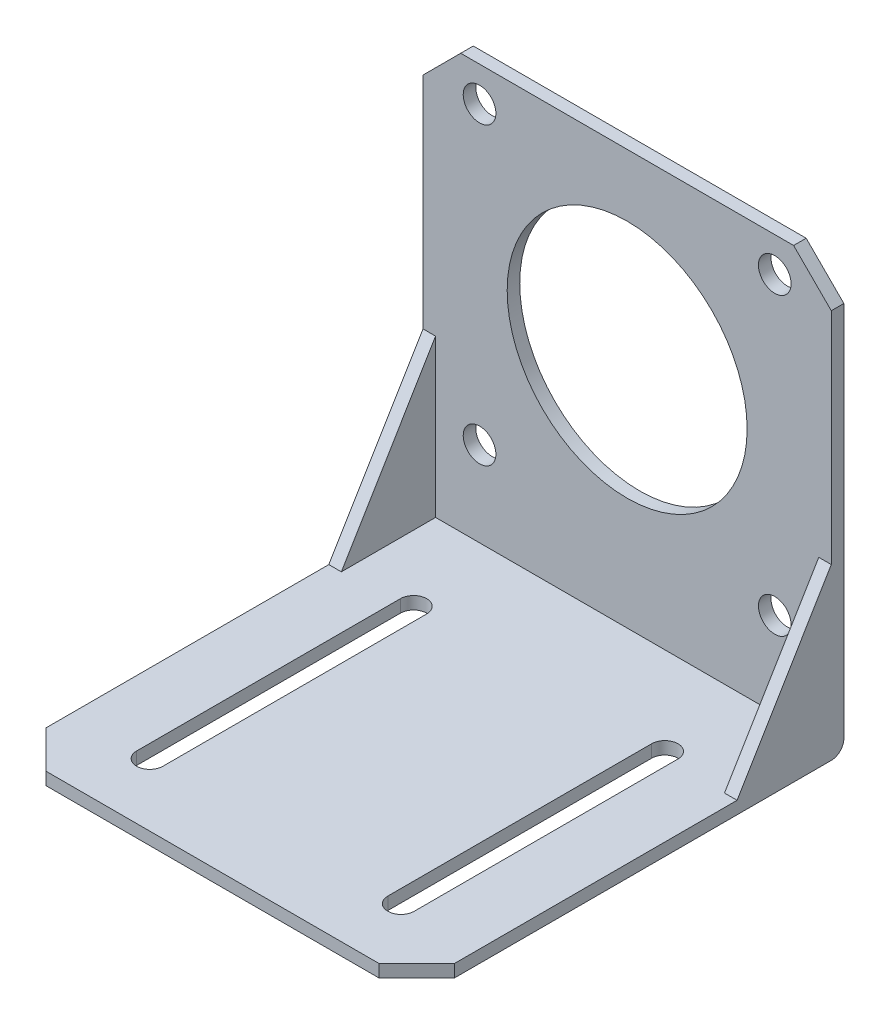
ISO-10303-21;
HEADER;
FILE_DESCRIPTION(('STEP AP214'),'2;1');
FILE_NAME('part.step','',(''),(''),'','','');
FILE_SCHEMA(('AUTOMOTIVE_DESIGN { 1 0 10303 214 1 1 1 1 }'));
ENDSEC;
DATA;
#1=APPLICATION_CONTEXT('core data for automotive mechanical design processes');
#2=APPLICATION_PROTOCOL_DEFINITION('international standard','automotive_design',2000,#1);
#3=PRODUCT_CONTEXT('',#1,'mechanical');
#4=PRODUCT('Part','Part','',(#3));
#5=PRODUCT_RELATED_PRODUCT_CATEGORY('part','',(#4));
#6=PRODUCT_DEFINITION_FORMATION('','',#4);
#7=PRODUCT_DEFINITION_CONTEXT('part definition',#1,'design');
#8=PRODUCT_DEFINITION('design','',#6,#7);
#9=PRODUCT_DEFINITION_SHAPE('','',#8);
#10=(LENGTH_UNIT() NAMED_UNIT(*) SI_UNIT(.MILLI.,.METRE.));
#11=(NAMED_UNIT(*) PLANE_ANGLE_UNIT() SI_UNIT($,.RADIAN.));
#12=(NAMED_UNIT(*) SI_UNIT($,.STERADIAN.) SOLID_ANGLE_UNIT());
#13=UNCERTAINTY_MEASURE_WITH_UNIT(LENGTH_MEASURE(1.E-05),#10,'distance_accuracy_value','');
#14=(GEOMETRIC_REPRESENTATION_CONTEXT(3) GLOBAL_UNCERTAINTY_ASSIGNED_CONTEXT((#13)) GLOBAL_UNIT_ASSIGNED_CONTEXT((#10,
#11,#12)) REPRESENTATION_CONTEXT('',''));
#15=CARTESIAN_POINT('',(0.,0.,0.));
#16=DIRECTION('',(0.,0.,1.));
#17=DIRECTION('',(1.,0.,0.));
#18=AXIS2_PLACEMENT_3D('',#15,#16,#17);
#19=CARTESIAN_POINT('',(32.5,0.,0.));
#20=DIRECTION('',(0.,0.,1.));
#21=DIRECTION('',(1.,0.,0.));
#22=AXIS2_PLACEMENT_3D('',#19,#20,#21);
#23=PLANE('',#22);
#24=CARTESIAN_POINT('',(23.5000000000007,15.5000000000007,0.));
#25=DIRECTION('',(0.,0.,1.));
#26=DIRECTION('',(1.,0.,0.));
#27=AXIS2_PLACEMENT_3D('',#24,#25,#26);
#28=CIRCLE('',#27,2.60000000000001);
#29=CARTESIAN_POINT('',(26.1000000000007,15.5000000000007,0.));
#30=VERTEX_POINT('',#29);
#31=EDGE_CURVE('E367',#30,#30,#28,.T.);
#32=ORIENTED_EDGE('',*,*,#31,.T.);
#33=EDGE_LOOP('',(#32));
#34=FACE_BOUND('',#33,.T.);
#35=CARTESIAN_POINT('',(-23.5,62.5,0.));
#36=DIRECTION('',(0.,0.,1.));
#37=DIRECTION('',(1.,0.,0.));
#38=AXIS2_PLACEMENT_3D('',#35,#36,#37);
#39=CIRCLE('',#38,2.6);
#40=CARTESIAN_POINT('',(-20.9,62.5,0.));
#41=VERTEX_POINT('',#40);
#42=EDGE_CURVE('E359',#41,#41,#39,.T.);
#43=ORIENTED_EDGE('',*,*,#42,.T.);
#44=EDGE_LOOP('',(#43));
#45=FACE_BOUND('',#44,.T.);
#46=DIRECTION('',(0.,1.,0.));
#47=VECTOR('',#46,1.);
#48=CARTESIAN_POINT('',(32.5,0.,0.));
#49=LINE('',#48,#47);
#50=CARTESIAN_POINT('',(32.5,2.,0.));
#51=VERTEX_POINT('',#50);
#52=CARTESIAN_POINT('',(32.5,62.,0.));
#53=VERTEX_POINT('',#52);
#54=EDGE_CURVE('E334',#51,#53,#49,.T.);
#55=ORIENTED_EDGE('',*,*,#54,.F.);
#56=DIRECTION('',(-1.,0.,0.));
#57=VECTOR('',#56,1.);
#58=CARTESIAN_POINT('',(32.5,2.,0.));
#59=LINE('',#58,#57);
#60=CARTESIAN_POINT('',(-32.5,2.,0.));
#61=VERTEX_POINT('',#60);
#62=EDGE_CURVE('E411',#51,#61,#59,.T.);
#63=ORIENTED_EDGE('',*,*,#62,.T.);
#64=DIRECTION('',(0.,1.,0.));
#65=VECTOR('',#64,1.);
#66=CARTESIAN_POINT('',(-32.5,0.,0.));
#67=LINE('',#66,#65);
#68=CARTESIAN_POINT('',(-32.5,62.,0.));
#69=VERTEX_POINT('',#68);
#70=EDGE_CURVE('E344',#61,#69,#67,.T.);
#71=ORIENTED_EDGE('',*,*,#70,.T.);
#72=DIRECTION('',(-0.707106781186546,-0.707106781186549,0.));
#73=VECTOR('',#72,1.);
#74=CARTESIAN_POINT('',(-26.5,68.,0.));
#75=LINE('',#74,#73);
#76=CARTESIAN_POINT('',(-26.5,68.,0.));
#77=VERTEX_POINT('',#76);
#78=EDGE_CURVE('E379',#69,#77,#75,.F.);
#79=ORIENTED_EDGE('',*,*,#78,.T.);
#80=DIRECTION('',(-1.,0.,0.));
#81=VECTOR('',#80,1.);
#82=CARTESIAN_POINT('',(32.5,68.,0.));
#83=LINE('',#82,#81);
#84=CARTESIAN_POINT('',(26.5,68.,0.));
#85=VERTEX_POINT('',#84);
#86=EDGE_CURVE('E323',#85,#77,#83,.T.);
#87=ORIENTED_EDGE('',*,*,#86,.F.);
#88=DIRECTION('',(0.70710678118655,-0.707106781186545,0.));
#89=VECTOR('',#88,1.);
#90=CARTESIAN_POINT('',(32.5,62.,0.));
#91=LINE('',#90,#89);
#92=EDGE_CURVE('E389',#85,#53,#91,.T.);
#93=ORIENTED_EDGE('',*,*,#92,.T.);
#94=EDGE_LOOP('',(#55,#63,#71,#79,#87,#93));
#95=FACE_BOUND('',#94,.T.);
#96=CARTESIAN_POINT('',(0.,39.,0.));
#97=DIRECTION('',(0.,0.,1.));
#98=DIRECTION('',(1.,0.,0.));
#99=AXIS2_PLACEMENT_3D('',#96,#97,#98);
#100=CIRCLE('',#99,19.1);
#101=CARTESIAN_POINT('',(19.1,39.,0.));
#102=VERTEX_POINT('',#101);
#103=EDGE_CURVE('E247',#102,#102,#100,.T.);
#104=ORIENTED_EDGE('',*,*,#103,.T.);
#105=EDGE_LOOP('',(#104));
#106=FACE_BOUND('',#105,.T.);
#107=CARTESIAN_POINT('',(23.5,62.5000000000007,0.));
#108=DIRECTION('',(0.,0.,1.));
#109=DIRECTION('',(1.,0.,0.));
#110=AXIS2_PLACEMENT_3D('',#107,#108,#109);
#111=CIRCLE('',#110,2.6);
#112=CARTESIAN_POINT('',(26.1,62.5000000000007,0.));
#113=VERTEX_POINT('',#112);
#114=EDGE_CURVE('E363',#113,#113,#111,.T.);
#115=ORIENTED_EDGE('',*,*,#114,.T.);
#116=EDGE_LOOP('',(#115));
#117=FACE_BOUND('',#116,.T.);
#118=CARTESIAN_POINT('',(-23.4999999999993,15.5,0.));
#119=DIRECTION('',(0.,0.,1.));
#120=DIRECTION('',(1.,0.,0.));
#121=AXIS2_PLACEMENT_3D('',#118,#119,#120);
#122=CIRCLE('',#121,2.6);
#123=CARTESIAN_POINT('',(-20.8999999999993,15.5,0.));
#124=VERTEX_POINT('',#123);
#125=EDGE_CURVE('E371',#124,#124,#122,.T.);
#126=ORIENTED_EDGE('',*,*,#125,.T.);
#127=EDGE_LOOP('',(#126));
#128=FACE_BOUND('',#127,.T.);
#129=ADVANCED_FACE('F63',(#34,#45,#95,#106,#117,#128),#23,.F.);
#130=CARTESIAN_POINT('',(32.5,68.,2.));
#131=DIRECTION('',(0.,0.,-1.));
#132=DIRECTION('',(0.,1.,0.));
#133=AXIS2_PLACEMENT_3D('',#130,#131,#132);
#134=PLANE('',#133);
#135=CARTESIAN_POINT('',(23.5000000000007,15.5000000000007,1.99999999999999));
#136=DIRECTION('',(0.,0.,-1.));
#137=DIRECTION('',(0.,1.,0.));
#138=AXIS2_PLACEMENT_3D('',#135,#136,#137);
#139=CIRCLE('',#138,2.60000000000001);
#140=CARTESIAN_POINT('',(23.5000000000007,18.1000000000007,1.99999999999999));
#141=VERTEX_POINT('',#140);
#142=EDGE_CURVE('E364',#141,#141,#139,.F.);
#143=ORIENTED_EDGE('',*,*,#142,.F.);
#144=EDGE_LOOP('',(#143));
#145=FACE_BOUND('',#144,.T.);
#146=CARTESIAN_POINT('',(-23.5,62.5,2.));
#147=DIRECTION('',(0.,0.,-1.));
#148=DIRECTION('',(0.,1.,0.));
#149=AXIS2_PLACEMENT_3D('',#146,#147,#148);
#150=CIRCLE('',#149,2.6);
#151=CARTESIAN_POINT('',(-23.5,65.1,2.));
#152=VERTEX_POINT('',#151);
#153=EDGE_CURVE('E356',#152,#152,#150,.F.);
#154=ORIENTED_EDGE('',*,*,#153,.F.);
#155=EDGE_LOOP('',(#154));
#156=FACE_BOUND('',#155,.T.);
#157=DIRECTION('',(0.,-1.,0.));
#158=VECTOR('',#157,1.);
#159=CARTESIAN_POINT('',(32.5,68.,2.));
#160=LINE('',#159,#158);
#161=CARTESIAN_POINT('',(32.5,62.,2.));
#162=VERTEX_POINT('',#161);
#163=CARTESIAN_POINT('',(32.5,27.,2.));
#164=VERTEX_POINT('',#163);
#165=EDGE_CURVE('E337',#162,#164,#160,.T.);
#166=ORIENTED_EDGE('',*,*,#165,.F.);
#167=DIRECTION('',(-0.70710678118655,0.707106781186545,0.));
#168=VECTOR('',#167,1.);
#169=CARTESIAN_POINT('',(32.5,62.,2.));
#170=LINE('',#169,#168);
#171=CARTESIAN_POINT('',(26.5,68.,2.));
#172=VERTEX_POINT('',#171);
#173=EDGE_CURVE('E385',#162,#172,#170,.T.);
#174=ORIENTED_EDGE('',*,*,#173,.T.);
#175=DIRECTION('',(-1.,0.,0.));
#176=VECTOR('',#175,1.);
#177=CARTESIAN_POINT('',(32.5,68.,2.));
#178=LINE('',#177,#176);
#179=CARTESIAN_POINT('',(-26.5,68.,2.));
#180=VERTEX_POINT('',#179);
#181=EDGE_CURVE('E353',#172,#180,#178,.T.);
#182=ORIENTED_EDGE('',*,*,#181,.T.);
#183=DIRECTION('',(0.707106781186546,0.707106781186549,0.));
#184=VECTOR('',#183,1.);
#185=CARTESIAN_POINT('',(-26.5,68.,2.));
#186=LINE('',#185,#184);
#187=CARTESIAN_POINT('',(-32.5,62.,2.));
#188=VERTEX_POINT('',#187);
#189=EDGE_CURVE('E374',#180,#188,#186,.F.);
#190=ORIENTED_EDGE('',*,*,#189,.T.);
#191=DIRECTION('',(0.,-1.,0.));
#192=VECTOR('',#191,1.);
#193=CARTESIAN_POINT('',(-32.5,68.,2.));
#194=LINE('',#193,#192);
#195=CARTESIAN_POINT('',(-32.5,27.,2.));
#196=VERTEX_POINT('',#195);
#197=EDGE_CURVE('E346',#188,#196,#194,.T.);
#198=ORIENTED_EDGE('',*,*,#197,.T.);
#199=DIRECTION('',(-1.,0.,0.));
#200=VECTOR('',#199,1.);
#201=CARTESIAN_POINT('',(32.5,27.,2.));
#202=LINE('',#201,#200);
#203=CARTESIAN_POINT('',(-30.5,27.,2.));
#204=VERTEX_POINT('',#203);
#205=EDGE_CURVE('E319',#204,#196,#202,.T.);
#206=ORIENTED_EDGE('',*,*,#205,.F.);
#207=DIRECTION('',(0.,1.,0.));
#208=VECTOR('',#207,1.);
#209=CARTESIAN_POINT('',(-30.5,27.,2.));
#210=LINE('',#209,#208);
#211=CARTESIAN_POINT('',(-30.5,2.00000000000001,2.));
#212=VERTEX_POINT('',#211);
#213=EDGE_CURVE('E302',#212,#204,#210,.T.);
#214=ORIENTED_EDGE('',*,*,#213,.F.);
#215=DIRECTION('',(1.,0.,0.));
#216=VECTOR('',#215,1.);
#217=CARTESIAN_POINT('',(-30.5,2.00000000000001,2.));
#218=LINE('',#217,#216);
#219=CARTESIAN_POINT('',(30.5,2.00000000000001,2.));
#220=VERTEX_POINT('',#219);
#221=EDGE_CURVE('E307',#212,#220,#218,.T.);
#222=ORIENTED_EDGE('',*,*,#221,.T.);
#223=DIRECTION('',(0.,1.,0.));
#224=VECTOR('',#223,1.);
#225=CARTESIAN_POINT('',(30.5,27.,2.));
#226=LINE('',#225,#224);
#227=CARTESIAN_POINT('',(30.5,27.,2.));
#228=VERTEX_POINT('',#227);
#229=EDGE_CURVE('E310',#220,#228,#226,.T.);
#230=ORIENTED_EDGE('',*,*,#229,.T.);
#231=EDGE_CURVE('E324',#164,#228,#202,.T.);
#232=ORIENTED_EDGE('',*,*,#231,.F.);
#233=EDGE_LOOP('',(#166,#174,#182,#190,#198,#206,#214,#222,#230,#232));
#234=FACE_BOUND('',#233,.T.);
#235=CARTESIAN_POINT('',(0.,39.,2.));
#236=DIRECTION('',(0.,0.,-1.));
#237=DIRECTION('',(0.,1.,0.));
#238=AXIS2_PLACEMENT_3D('',#235,#236,#237);
#239=CIRCLE('',#238,19.1);
#240=CARTESIAN_POINT('',(0.,58.1,2.));
#241=VERTEX_POINT('',#240);
#242=EDGE_CURVE('E244',#241,#241,#239,.F.);
#243=ORIENTED_EDGE('',*,*,#242,.F.);
#244=EDGE_LOOP('',(#243));
#245=FACE_BOUND('',#244,.T.);
#246=CARTESIAN_POINT('',(23.5,62.5000000000007,2.));
#247=DIRECTION('',(0.,0.,-1.));
#248=DIRECTION('',(0.,1.,0.));
#249=AXIS2_PLACEMENT_3D('',#246,#247,#248);
#250=CIRCLE('',#249,2.6);
#251=CARTESIAN_POINT('',(23.5,65.1000000000007,2.));
#252=VERTEX_POINT('',#251);
#253=EDGE_CURVE('E360',#252,#252,#250,.F.);
#254=ORIENTED_EDGE('',*,*,#253,.F.);
#255=EDGE_LOOP('',(#254));
#256=FACE_BOUND('',#255,.T.);
#257=CARTESIAN_POINT('',(-23.4999999999993,15.5,1.99999999999999));
#258=DIRECTION('',(0.,0.,-1.));
#259=DIRECTION('',(0.,1.,0.));
#260=AXIS2_PLACEMENT_3D('',#257,#258,#259);
#261=CIRCLE('',#260,2.6);
#262=CARTESIAN_POINT('',(-23.4999999999993,18.1,1.99999999999999));
#263=VERTEX_POINT('',#262);
#264=EDGE_CURVE('E368',#263,#263,#261,.F.);
#265=ORIENTED_EDGE('',*,*,#264,.F.);
#266=EDGE_LOOP('',(#265));
#267=FACE_BOUND('',#266,.T.);
#268=ADVANCED_FACE('F441',(#145,#156,#234,#245,#256,#267),#134,.F.);
#269=CARTESIAN_POINT('',(32.5,0.,68.));
#270=DIRECTION('',(0.,1.,0.));
#271=DIRECTION('',(0.,0.,1.));
#272=AXIS2_PLACEMENT_3D('',#269,#270,#271);
#273=PLANE('',#272);
#274=CARTESIAN_POINT('',(-20.,0.,16.));
#275=DIRECTION('',(0.,1.,0.));
#276=DIRECTION('',(0.,0.,1.));
#277=AXIS2_PLACEMENT_3D('',#274,#275,#276);
#278=CIRCLE('',#277,2.1);
#279=CARTESIAN_POINT('',(-17.9,0.,16.));
#280=VERTEX_POINT('',#279);
#281=CARTESIAN_POINT('',(-22.1,0.,16.));
#282=VERTEX_POINT('',#281);
#283=EDGE_CURVE('E228',#280,#282,#278,.T.);
#284=ORIENTED_EDGE('',*,*,#283,.T.);
#285=DIRECTION('',(0.,0.,1.));
#286=VECTOR('',#285,1.);
#287=CARTESIAN_POINT('',(-22.1,0.,16.));
#288=LINE('',#287,#286);
#289=CARTESIAN_POINT('',(-22.1,0.,58.));
#290=VERTEX_POINT('',#289);
#291=EDGE_CURVE('E261',#282,#290,#288,.T.);
#292=ORIENTED_EDGE('',*,*,#291,.T.);
#293=CARTESIAN_POINT('',(-20.,0.,58.));
#294=DIRECTION('',(0.,1.,0.));
#295=DIRECTION('',(0.,0.,1.));
#296=AXIS2_PLACEMENT_3D('',#293,#294,#295);
#297=CIRCLE('',#296,2.1);
#298=CARTESIAN_POINT('',(-17.9,0.,58.));
#299=VERTEX_POINT('',#298);
#300=EDGE_CURVE('E264',#290,#299,#297,.T.);
#301=ORIENTED_EDGE('',*,*,#300,.T.);
#302=DIRECTION('',(0.,0.,-1.));
#303=VECTOR('',#302,1.);
#304=CARTESIAN_POINT('',(-17.9,0.,16.));
#305=LINE('',#304,#303);
#306=EDGE_CURVE('E267',#299,#280,#305,.T.);
#307=ORIENTED_EDGE('',*,*,#306,.T.);
#308=EDGE_LOOP('',(#284,#292,#301,#307));
#309=FACE_BOUND('',#308,.T.);
#310=DIRECTION('',(0.,0.,-1.));
#311=VECTOR('',#310,1.);
#312=CARTESIAN_POINT('',(-32.5,0.,68.));
#313=LINE('',#312,#311);
#314=CARTESIAN_POINT('',(-32.5,0.,62.));
#315=VERTEX_POINT('',#314);
#316=CARTESIAN_POINT('',(-32.5,0.,2.));
#317=VERTEX_POINT('',#316);
#318=EDGE_CURVE('E315',#315,#317,#313,.T.);
#319=ORIENTED_EDGE('',*,*,#318,.T.);
#320=DIRECTION('',(-1.,0.,0.));
#321=VECTOR('',#320,1.);
#322=CARTESIAN_POINT('',(32.5,0.,2.));
#323=LINE('',#322,#321);
#324=CARTESIAN_POINT('',(32.5,0.,2.));
#325=VERTEX_POINT('',#324);
#326=EDGE_CURVE('E71',#317,#325,#323,.F.);
#327=ORIENTED_EDGE('',*,*,#326,.T.);
#328=DIRECTION('',(0.,0.,-1.));
#329=VECTOR('',#328,1.);
#330=CARTESIAN_POINT('',(32.5,0.,68.));
#331=LINE('',#330,#329);
#332=CARTESIAN_POINT('',(32.5,0.,62.));
#333=VERTEX_POINT('',#332);
#334=EDGE_CURVE('E332',#333,#325,#331,.T.);
#335=ORIENTED_EDGE('',*,*,#334,.F.);
#336=DIRECTION('',(-0.70710678118655,0.,0.707106781186545));
#337=VECTOR('',#336,1.);
#338=CARTESIAN_POINT('',(32.5,0.,62.));
#339=LINE('',#338,#337);
#340=CARTESIAN_POINT('',(26.5,0.,68.));
#341=VERTEX_POINT('',#340);
#342=EDGE_CURVE('E405',#333,#341,#339,.T.);
#343=ORIENTED_EDGE('',*,*,#342,.T.);
#344=DIRECTION('',(-1.,0.,0.));
#345=VECTOR('',#344,1.);
#346=CARTESIAN_POINT('',(32.5,0.,68.));
#347=LINE('',#346,#345);
#348=CARTESIAN_POINT('',(-26.5,0.,68.));
#349=VERTEX_POINT('',#348);
#350=EDGE_CURVE('E342',#341,#349,#347,.T.);
#351=ORIENTED_EDGE('',*,*,#350,.T.);
#352=DIRECTION('',(0.707106781186546,0.,0.707106781186549));
#353=VECTOR('',#352,1.);
#354=CARTESIAN_POINT('',(-26.5,0.,68.));
#355=LINE('',#354,#353);
#356=EDGE_CURVE('E395',#349,#315,#355,.F.);
#357=ORIENTED_EDGE('',*,*,#356,.T.);
#358=EDGE_LOOP('',(#319,#327,#335,#343,#351,#357));
#359=FACE_BOUND('',#358,.T.);
#360=CARTESIAN_POINT('',(20.,0.,16.));
#361=DIRECTION('',(0.,1.,0.));
#362=DIRECTION('',(0.,0.,-1.));
#363=AXIS2_PLACEMENT_3D('',#360,#361,#362);
#364=CIRCLE('',#363,2.1);
#365=CARTESIAN_POINT('',(22.1,0.,16.));
#366=VERTEX_POINT('',#365);
#367=CARTESIAN_POINT('',(17.9,0.,16.));
#368=VERTEX_POINT('',#367);
#369=EDGE_CURVE('E222',#366,#368,#364,.T.);
#370=ORIENTED_EDGE('',*,*,#369,.T.);
#371=DIRECTION('',(0.,0.,1.));
#372=VECTOR('',#371,1.);
#373=CARTESIAN_POINT('',(17.9,0.,16.));
#374=LINE('',#373,#372);
#375=CARTESIAN_POINT('',(17.9,0.,58.));
#376=VERTEX_POINT('',#375);
#377=EDGE_CURVE('E232',#368,#376,#374,.T.);
#378=ORIENTED_EDGE('',*,*,#377,.T.);
#379=CARTESIAN_POINT('',(20.,0.,58.));
#380=DIRECTION('',(0.,1.,0.));
#381=DIRECTION('',(0.,0.,-1.));
#382=AXIS2_PLACEMENT_3D('',#379,#380,#381);
#383=CIRCLE('',#382,2.1);
#384=CARTESIAN_POINT('',(22.1,0.,58.));
#385=VERTEX_POINT('',#384);
#386=EDGE_CURVE('E238',#376,#385,#383,.T.);
#387=ORIENTED_EDGE('',*,*,#386,.T.);
#388=DIRECTION('',(0.,0.,-1.));
#389=VECTOR('',#388,1.);
#390=CARTESIAN_POINT('',(22.1,0.,16.));
#391=LINE('',#390,#389);
#392=EDGE_CURVE('E243',#385,#366,#391,.T.);
#393=ORIENTED_EDGE('',*,*,#392,.T.);
#394=EDGE_LOOP('',(#370,#378,#387,#393));
#395=FACE_BOUND('',#394,.T.);
#396=ADVANCED_FACE('F241',(#309,#359,#395),#273,.F.);
#397=CARTESIAN_POINT('',(32.5,2.00000000000001,1.99999999999999));
#398=DIRECTION('',(0.,-1.,0.));
#399=DIRECTION('',(0.,0.,-1.));
#400=AXIS2_PLACEMENT_3D('',#397,#398,#399);
#401=PLANE('',#400);
#402=DIRECTION('',(0.,0.,1.));
#403=VECTOR('',#402,1.);
#404=CARTESIAN_POINT('',(17.9,2.00000000000001,1.99999999999999));
#405=LINE('',#404,#403);
#406=CARTESIAN_POINT('',(17.9,2.,16.));
#407=VERTEX_POINT('',#406);
#408=CARTESIAN_POINT('',(17.9,2.,58.));
#409=VERTEX_POINT('',#408);
#410=EDGE_CURVE('E285',#407,#409,#405,.T.);
#411=ORIENTED_EDGE('',*,*,#410,.F.);
#412=CARTESIAN_POINT('',(20.,2.00000000000002,16.));
#413=DIRECTION('',(0.,-1.,0.));
#414=DIRECTION('',(0.,0.,-1.));
#415=AXIS2_PLACEMENT_3D('',#412,#413,#414);
#416=CIRCLE('',#415,2.1);
#417=CARTESIAN_POINT('',(22.1,2.,16.));
#418=VERTEX_POINT('',#417);
#419=EDGE_CURVE('E225',#407,#418,#416,.T.);
#420=ORIENTED_EDGE('',*,*,#419,.T.);
#421=DIRECTION('',(0.,0.,1.));
#422=VECTOR('',#421,1.);
#423=CARTESIAN_POINT('',(22.1,2.00000000000001,1.99999999999999));
#424=LINE('',#423,#422);
#425=CARTESIAN_POINT('',(22.1,2.,58.));
#426=VERTEX_POINT('',#425);
#427=EDGE_CURVE('E279',#418,#426,#424,.T.);
#428=ORIENTED_EDGE('',*,*,#427,.T.);
#429=CARTESIAN_POINT('',(20.,2.,58.));
#430=DIRECTION('',(0.,-1.,0.));
#431=DIRECTION('',(0.,0.,-1.));
#432=AXIS2_PLACEMENT_3D('',#429,#430,#431);
#433=CIRCLE('',#432,2.09999999999999);
#434=EDGE_CURVE('E282',#426,#409,#433,.T.);
#435=ORIENTED_EDGE('',*,*,#434,.T.);
#436=EDGE_LOOP('',(#411,#420,#428,#435));
#437=FACE_BOUND('',#436,.T.);
#438=DIRECTION('',(-1.,0.,0.));
#439=VECTOR('',#438,1.);
#440=CARTESIAN_POINT('',(32.5,2.,68.));
#441=LINE('',#440,#439);
#442=CARTESIAN_POINT('',(26.5,2.,68.));
#443=VERTEX_POINT('',#442);
#444=CARTESIAN_POINT('',(-26.5,2.,68.));
#445=VERTEX_POINT('',#444);
#446=EDGE_CURVE('E351',#443,#445,#441,.T.);
#447=ORIENTED_EDGE('',*,*,#446,.F.);
#448=DIRECTION('',(0.70710678118655,0.,-0.707106781186545));
#449=VECTOR('',#448,1.);
#450=CARTESIAN_POINT('',(32.5,2.,62.));
#451=LINE('',#450,#449);
#452=CARTESIAN_POINT('',(32.5,2.,62.));
#453=VERTEX_POINT('',#452);
#454=EDGE_CURVE('E409',#443,#453,#451,.T.);
#455=ORIENTED_EDGE('',*,*,#454,.T.);
#456=DIRECTION('',(0.,0.,1.));
#457=VECTOR('',#456,1.);
#458=CARTESIAN_POINT('',(32.5,2.00000000000001,1.99999999999999));
#459=LINE('',#458,#457);
#460=CARTESIAN_POINT('',(32.5,2.00000000000001,17.));
#461=VERTEX_POINT('',#460);
#462=EDGE_CURVE('E339',#461,#453,#459,.T.);
#463=ORIENTED_EDGE('',*,*,#462,.F.);
#464=DIRECTION('',(-1.,0.,0.));
#465=VECTOR('',#464,1.);
#466=CARTESIAN_POINT('',(32.5,2.00000000000001,17.));
#467=LINE('',#466,#465);
#468=CARTESIAN_POINT('',(30.5,2.00000000000001,17.));
#469=VERTEX_POINT('',#468);
#470=EDGE_CURVE('E328',#461,#469,#467,.T.);
#471=ORIENTED_EDGE('',*,*,#470,.T.);
#472=DIRECTION('',(0.,0.,-1.));
#473=VECTOR('',#472,1.);
#474=CARTESIAN_POINT('',(30.5,2.00000000000001,2.));
#475=LINE('',#474,#473);
#476=EDGE_CURVE('E298',#469,#220,#475,.T.);
#477=ORIENTED_EDGE('',*,*,#476,.T.);
#478=ORIENTED_EDGE('',*,*,#221,.F.);
#479=DIRECTION('',(0.,0.,-1.));
#480=VECTOR('',#479,1.);
#481=CARTESIAN_POINT('',(-30.5,2.00000000000001,2.));
#482=LINE('',#481,#480);
#483=CARTESIAN_POINT('',(-30.5,2.00000000000001,17.));
#484=VERTEX_POINT('',#483);
#485=EDGE_CURVE('E299',#484,#212,#482,.T.);
#486=ORIENTED_EDGE('',*,*,#485,.F.);
#487=CARTESIAN_POINT('',(-32.5,2.00000000000001,17.));
#488=VERTEX_POINT('',#487);
#489=EDGE_CURVE('E327',#484,#488,#467,.T.);
#490=ORIENTED_EDGE('',*,*,#489,.T.);
#491=DIRECTION('',(0.,0.,1.));
#492=VECTOR('',#491,1.);
#493=CARTESIAN_POINT('',(-32.5,2.00000000000001,1.99999999999999));
#494=LINE('',#493,#492);
#495=CARTESIAN_POINT('',(-32.5,2.,62.));
#496=VERTEX_POINT('',#495);
#497=EDGE_CURVE('E335',#488,#496,#494,.T.);
#498=ORIENTED_EDGE('',*,*,#497,.T.);
#499=DIRECTION('',(-0.707106781186546,0.,-0.707106781186549));
#500=VECTOR('',#499,1.);
#501=CARTESIAN_POINT('',(-26.5,2.,68.));
#502=LINE('',#501,#500);
#503=EDGE_CURVE('E399',#496,#445,#502,.F.);
#504=ORIENTED_EDGE('',*,*,#503,.T.);
#505=EDGE_LOOP('',(#447,#455,#463,#471,#477,#478,#486,#490,#498,#504));
#506=FACE_BOUND('',#505,.T.);
#507=CARTESIAN_POINT('',(-20.,2.00000000000002,16.));
#508=DIRECTION('',(0.,-1.,0.));
#509=DIRECTION('',(0.,0.,-1.));
#510=AXIS2_PLACEMENT_3D('',#507,#508,#509);
#511=CIRCLE('',#510,2.1);
#512=CARTESIAN_POINT('',(-17.9,2.,16.));
#513=VERTEX_POINT('',#512);
#514=CARTESIAN_POINT('',(-22.1,2.,16.));
#515=VERTEX_POINT('',#514);
#516=EDGE_CURVE('E296',#513,#515,#511,.F.);
#517=ORIENTED_EDGE('',*,*,#516,.F.);
#518=DIRECTION('',(0.,0.,1.));
#519=VECTOR('',#518,1.);
#520=CARTESIAN_POINT('',(-17.9,2.00000000000001,1.99999999999999));
#521=LINE('',#520,#519);
#522=CARTESIAN_POINT('',(-17.9,2.,58.));
#523=VERTEX_POINT('',#522);
#524=EDGE_CURVE('E288',#513,#523,#521,.T.);
#525=ORIENTED_EDGE('',*,*,#524,.T.);
#526=CARTESIAN_POINT('',(-20.,2.,58.));
#527=DIRECTION('',(0.,-1.,0.));
#528=DIRECTION('',(0.,0.,-1.));
#529=AXIS2_PLACEMENT_3D('',#526,#527,#528);
#530=CIRCLE('',#529,2.09999999999999);
#531=CARTESIAN_POINT('',(-22.1,2.,58.));
#532=VERTEX_POINT('',#531);
#533=EDGE_CURVE('E291',#532,#523,#530,.F.);
#534=ORIENTED_EDGE('',*,*,#533,.F.);
#535=DIRECTION('',(0.,0.,1.));
#536=VECTOR('',#535,1.);
#537=CARTESIAN_POINT('',(-22.1,2.00000000000001,2.00000000000001));
#538=LINE('',#537,#536);
#539=EDGE_CURVE('E294',#515,#532,#538,.T.);
#540=ORIENTED_EDGE('',*,*,#539,.F.);
#541=EDGE_LOOP('',(#517,#525,#534,#540));
#542=FACE_BOUND('',#541,.T.);
#543=ADVANCED_FACE('F467',(#437,#506,#542),#401,.F.);
#544=CARTESIAN_POINT('',(32.5,8.02941176470588,13.3823529411765));
#545=DIRECTION('',(0.,0.514495755427526,0.857492925712544));
#546=DIRECTION('',(0.,-0.857492925712544,0.514495755427526));
#547=AXIS2_PLACEMENT_3D('',#544,#545,#546);
#548=PLANE('',#547);
#549=ORIENTED_EDGE('',*,*,#489,.F.);
#550=DIRECTION('',(0.,-0.857492925712544,0.514495755427526));
#551=VECTOR('',#550,1.);
#552=CARTESIAN_POINT('',(-30.5,2.00000000000001,17.));
#553=LINE('',#552,#551);
#554=EDGE_CURVE('E305',#204,#484,#553,.T.);
#555=ORIENTED_EDGE('',*,*,#554,.F.);
#556=ORIENTED_EDGE('',*,*,#205,.T.);
#557=DIRECTION('',(0.,0.857492925712544,-0.514495755427526));
#558=VECTOR('',#557,1.);
#559=CARTESIAN_POINT('',(-32.5,8.02941176470588,13.3823529411765));
#560=LINE('',#559,#558);
#561=EDGE_CURVE('E320',#488,#196,#560,.T.);
#562=ORIENTED_EDGE('',*,*,#561,.F.);
#563=EDGE_LOOP('',(#549,#555,#556,#562));
#564=FACE_BOUND('',#563,.T.);
#565=ADVANCED_FACE('F473',(#564),#548,.T.);
#566=DIRECTION('',(0.,-0.857492925712544,0.514495755427526));
#567=VECTOR('',#566,1.);
#568=CARTESIAN_POINT('',(30.5,2.00000000000001,17.));
#569=LINE('',#568,#567);
#570=EDGE_CURVE('E303',#228,#469,#569,.T.);
#571=ORIENTED_EDGE('',*,*,#570,.T.);
#572=ORIENTED_EDGE('',*,*,#470,.F.);
#573=DIRECTION('',(0.,0.857492925712544,-0.514495755427526));
#574=VECTOR('',#573,1.);
#575=CARTESIAN_POINT('',(32.5,8.02941176470588,13.3823529411765));
#576=LINE('',#575,#574);
#577=EDGE_CURVE('E316',#461,#164,#576,.T.);
#578=ORIENTED_EDGE('',*,*,#577,.T.);
#579=ORIENTED_EDGE('',*,*,#231,.T.);
#580=EDGE_LOOP('',(#571,#572,#578,#579));
#581=FACE_BOUND('',#580,.T.);
#582=ADVANCED_FACE('F447',(#581),#548,.T.);
#583=CARTESIAN_POINT('',(-32.5,0.,0.));
#584=DIRECTION('',(1.,0.,0.));
#585=DIRECTION('',(0.,0.,-1.));
#586=AXIS2_PLACEMENT_3D('',#583,#584,#585);
#587=PLANE('',#586);
#588=ORIENTED_EDGE('',*,*,#70,.F.);
#589=CARTESIAN_POINT('',(-32.5,2.,2.));
#590=DIRECTION('',(1.,0.,0.));
#591=DIRECTION('',(0.,0.,-1.));
#592=AXIS2_PLACEMENT_3D('',#589,#590,#591);
#593=CIRCLE('',#592,2.);
#594=EDGE_CURVE('E85',#61,#317,#593,.F.);
#595=ORIENTED_EDGE('',*,*,#594,.T.);
#596=ORIENTED_EDGE('',*,*,#318,.F.);
#597=DIRECTION('',(0.,1.,0.));
#598=VECTOR('',#597,1.);
#599=CARTESIAN_POINT('',(-32.5,0.,62.));
#600=LINE('',#599,#598);
#601=EDGE_CURVE('E397',#315,#496,#600,.T.);
#602=ORIENTED_EDGE('',*,*,#601,.T.);
#603=ORIENTED_EDGE('',*,*,#497,.F.);
#604=ORIENTED_EDGE('',*,*,#561,.T.);
#605=ORIENTED_EDGE('',*,*,#197,.F.);
#606=DIRECTION('',(0.,0.,-1.));
#607=VECTOR('',#606,1.);
#608=CARTESIAN_POINT('',(-32.5,62.,0.));
#609=LINE('',#608,#607);
#610=EDGE_CURVE('E376',#188,#69,#609,.T.);
#611=ORIENTED_EDGE('',*,*,#610,.T.);
#612=EDGE_LOOP('',(#588,#595,#596,#602,#603,#604,#605,#611));
#613=FACE_BOUND('',#612,.T.);
#614=ADVANCED_FACE('F420',(#613),#587,.F.);
#615=CARTESIAN_POINT('',(32.5,0.,0.));
#616=DIRECTION('',(1.,0.,0.));
#617=DIRECTION('',(0.,0.,-1.));
#618=AXIS2_PLACEMENT_3D('',#615,#616,#617);
#619=PLANE('',#618);
#620=ORIENTED_EDGE('',*,*,#334,.T.);
#621=CARTESIAN_POINT('',(32.5,2.,2.));
#622=DIRECTION('',(1.,0.,0.));
#623=DIRECTION('',(0.,0.,-1.));
#624=AXIS2_PLACEMENT_3D('',#621,#622,#623);
#625=CIRCLE('',#624,2.);
#626=EDGE_CURVE('E12',#325,#51,#625,.T.);
#627=ORIENTED_EDGE('',*,*,#626,.T.);
#628=ORIENTED_EDGE('',*,*,#54,.T.);
#629=DIRECTION('',(0.,0.,1.));
#630=VECTOR('',#629,1.);
#631=CARTESIAN_POINT('',(32.5,62.,2.));
#632=LINE('',#631,#630);
#633=EDGE_CURVE('E382',#53,#162,#632,.T.);
#634=ORIENTED_EDGE('',*,*,#633,.T.);
#635=ORIENTED_EDGE('',*,*,#165,.T.);
#636=ORIENTED_EDGE('',*,*,#577,.F.);
#637=ORIENTED_EDGE('',*,*,#462,.T.);
#638=DIRECTION('',(0.,-1.,0.));
#639=VECTOR('',#638,1.);
#640=CARTESIAN_POINT('',(32.5,0.,62.));
#641=LINE('',#640,#639);
#642=EDGE_CURVE('E402',#453,#333,#641,.T.);
#643=ORIENTED_EDGE('',*,*,#642,.T.);
#644=EDGE_LOOP('',(#620,#627,#628,#634,#635,#636,#637,#643));
#645=FACE_BOUND('',#644,.T.);
#646=ADVANCED_FACE('F437',(#645),#619,.T.);
#647=CARTESIAN_POINT('',(32.5,68.,0.));
#648=DIRECTION('',(0.,-1.,0.));
#649=DIRECTION('',(0.,0.,-1.));
#650=AXIS2_PLACEMENT_3D('',#647,#648,#649);
#651=PLANE('',#650);
#652=ORIENTED_EDGE('',*,*,#181,.F.);
#653=DIRECTION('',(0.,0.,-1.));
#654=VECTOR('',#653,1.);
#655=CARTESIAN_POINT('',(26.5,68.,0.));
#656=LINE('',#655,#654);
#657=EDGE_CURVE('E387',#172,#85,#656,.T.);
#658=ORIENTED_EDGE('',*,*,#657,.T.);
#659=ORIENTED_EDGE('',*,*,#86,.T.);
#660=DIRECTION('',(0.,0.,1.));
#661=VECTOR('',#660,1.);
#662=CARTESIAN_POINT('',(-26.5,68.,0.));
#663=LINE('',#662,#661);
#664=EDGE_CURVE('E331',#77,#180,#663,.T.);
#665=ORIENTED_EDGE('',*,*,#664,.T.);
#666=EDGE_LOOP('',(#652,#658,#659,#665));
#667=FACE_BOUND('',#666,.T.);
#668=ADVANCED_FACE('F477',(#667),#651,.F.);
#669=CARTESIAN_POINT('',(32.5,2.,68.));
#670=DIRECTION('',(0.,0.,-1.));
#671=DIRECTION('',(-1.,0.,0.));
#672=AXIS2_PLACEMENT_3D('',#669,#670,#671);
#673=PLANE('',#672);
#674=ORIENTED_EDGE('',*,*,#350,.F.);
#675=DIRECTION('',(0.,1.,0.));
#676=VECTOR('',#675,1.);
#677=CARTESIAN_POINT('',(26.5,2.,68.));
#678=LINE('',#677,#676);
#679=EDGE_CURVE('E407',#341,#443,#678,.T.);
#680=ORIENTED_EDGE('',*,*,#679,.T.);
#681=ORIENTED_EDGE('',*,*,#446,.T.);
#682=DIRECTION('',(0.,-1.,0.));
#683=VECTOR('',#682,1.);
#684=CARTESIAN_POINT('',(-26.5,2.,68.));
#685=LINE('',#684,#683);
#686=EDGE_CURVE('E392',#445,#349,#685,.T.);
#687=ORIENTED_EDGE('',*,*,#686,.T.);
#688=EDGE_LOOP('',(#674,#680,#681,#687));
#689=FACE_BOUND('',#688,.T.);
#690=ADVANCED_FACE('F458',(#689),#673,.F.);
#691=CARTESIAN_POINT('',(-30.5,0.,0.));
#692=DIRECTION('',(1.,0.,0.));
#693=DIRECTION('',(0.,0.,-1.));
#694=AXIS2_PLACEMENT_3D('',#691,#692,#693);
#695=PLANE('',#694);
#696=ORIENTED_EDGE('',*,*,#485,.T.);
#697=ORIENTED_EDGE('',*,*,#213,.T.);
#698=ORIENTED_EDGE('',*,*,#554,.T.);
#699=EDGE_LOOP('',(#696,#697,#698));
#700=FACE_BOUND('',#699,.T.);
#701=ADVANCED_FACE('F484',(#700),#695,.T.);
#702=CARTESIAN_POINT('',(30.5,0.,0.));
#703=DIRECTION('',(1.,0.,0.));
#704=DIRECTION('',(0.,0.,-1.));
#705=AXIS2_PLACEMENT_3D('',#702,#703,#704);
#706=PLANE('',#705);
#707=ORIENTED_EDGE('',*,*,#476,.F.);
#708=ORIENTED_EDGE('',*,*,#570,.F.);
#709=ORIENTED_EDGE('',*,*,#229,.F.);
#710=EDGE_LOOP('',(#707,#708,#709));
#711=FACE_BOUND('',#710,.T.);
#712=ADVANCED_FACE('F716',(#711),#706,.F.);
#713=CARTESIAN_POINT('',(-20.,68.,16.));
#714=DIRECTION('',(0.,-1.,0.));
#715=DIRECTION('',(0.,0.,-1.));
#716=AXIS2_PLACEMENT_3D('',#713,#714,#715);
#717=CYLINDRICAL_SURFACE('',#716,2.1);
#718=ORIENTED_EDGE('',*,*,#516,.T.);
#719=DIRECTION('',(0.,-1.,0.));
#720=VECTOR('',#719,1.);
#721=CARTESIAN_POINT('',(-22.1,68.,16.));
#722=LINE('',#721,#720);
#723=EDGE_CURVE('E277',#515,#282,#722,.T.);
#724=ORIENTED_EDGE('',*,*,#723,.T.);
#725=ORIENTED_EDGE('',*,*,#283,.F.);
#726=DIRECTION('',(0.,-1.,0.));
#727=VECTOR('',#726,1.);
#728=CARTESIAN_POINT('',(-17.9,68.,16.));
#729=LINE('',#728,#727);
#730=EDGE_CURVE('E270',#513,#280,#729,.T.);
#731=ORIENTED_EDGE('',*,*,#730,.F.);
#732=EDGE_LOOP('',(#718,#724,#725,#731));
#733=FACE_BOUND('',#732,.T.);
#734=ADVANCED_FACE('F707',(#733),#717,.F.);
#735=CARTESIAN_POINT('',(-22.1,68.,16.));
#736=DIRECTION('',(1.,0.,0.));
#737=DIRECTION('',(0.,0.,-1.));
#738=AXIS2_PLACEMENT_3D('',#735,#736,#737);
#739=PLANE('',#738);
#740=ORIENTED_EDGE('',*,*,#539,.T.);
#741=DIRECTION('',(0.,-1.,0.));
#742=VECTOR('',#741,1.);
#743=CARTESIAN_POINT('',(-22.1,68.,58.));
#744=LINE('',#743,#742);
#745=EDGE_CURVE('E275',#532,#290,#744,.T.);
#746=ORIENTED_EDGE('',*,*,#745,.T.);
#747=ORIENTED_EDGE('',*,*,#291,.F.);
#748=ORIENTED_EDGE('',*,*,#723,.F.);
#749=EDGE_LOOP('',(#740,#746,#747,#748));
#750=FACE_BOUND('',#749,.T.);
#751=ADVANCED_FACE('F697',(#750),#739,.T.);
#752=CARTESIAN_POINT('',(-20.,68.,58.));
#753=DIRECTION('',(0.,-1.,0.));
#754=DIRECTION('',(0.,0.,-1.));
#755=AXIS2_PLACEMENT_3D('',#752,#753,#754);
#756=CYLINDRICAL_SURFACE('',#755,2.1);
#757=ORIENTED_EDGE('',*,*,#533,.T.);
#758=DIRECTION('',(0.,-1.,0.));
#759=VECTOR('',#758,1.);
#760=CARTESIAN_POINT('',(-17.9,68.,58.));
#761=LINE('',#760,#759);
#762=EDGE_CURVE('E273',#523,#299,#761,.T.);
#763=ORIENTED_EDGE('',*,*,#762,.T.);
#764=ORIENTED_EDGE('',*,*,#300,.F.);
#765=ORIENTED_EDGE('',*,*,#745,.F.);
#766=EDGE_LOOP('',(#757,#763,#764,#765));
#767=FACE_BOUND('',#766,.T.);
#768=ADVANCED_FACE('F687',(#767),#756,.F.);
#769=CARTESIAN_POINT('',(-17.9,68.,16.));
#770=DIRECTION('',(-1.,0.,0.));
#771=DIRECTION('',(0.,0.,1.));
#772=AXIS2_PLACEMENT_3D('',#769,#770,#771);
#773=PLANE('',#772);
#774=ORIENTED_EDGE('',*,*,#524,.F.);
#775=ORIENTED_EDGE('',*,*,#730,.T.);
#776=ORIENTED_EDGE('',*,*,#306,.F.);
#777=ORIENTED_EDGE('',*,*,#762,.F.);
#778=EDGE_LOOP('',(#774,#775,#776,#777));
#779=FACE_BOUND('',#778,.T.);
#780=ADVANCED_FACE('F678',(#779),#773,.T.);
#781=CARTESIAN_POINT('',(20.,68.,16.));
#782=DIRECTION('',(0.,-1.,0.));
#783=DIRECTION('',(0.,0.,-1.));
#784=AXIS2_PLACEMENT_3D('',#781,#782,#783);
#785=CYLINDRICAL_SURFACE('',#784,2.1);
#786=ORIENTED_EDGE('',*,*,#419,.F.);
#787=DIRECTION('',(0.,-1.,0.));
#788=VECTOR('',#787,1.);
#789=CARTESIAN_POINT('',(17.9,68.,16.));
#790=LINE('',#789,#788);
#791=EDGE_CURVE('E217',#407,#368,#790,.T.);
#792=ORIENTED_EDGE('',*,*,#791,.T.);
#793=ORIENTED_EDGE('',*,*,#369,.F.);
#794=DIRECTION('',(0.,-1.,0.));
#795=VECTOR('',#794,1.);
#796=CARTESIAN_POINT('',(22.1,68.,16.));
#797=LINE('',#796,#795);
#798=EDGE_CURVE('E254',#418,#366,#797,.T.);
#799=ORIENTED_EDGE('',*,*,#798,.F.);
#800=EDGE_LOOP('',(#786,#792,#793,#799));
#801=FACE_BOUND('',#800,.T.);
#802=ADVANCED_FACE('F219',(#801),#785,.F.);
#803=CARTESIAN_POINT('',(17.9,68.,16.));
#804=DIRECTION('',(1.,0.,0.));
#805=DIRECTION('',(0.,0.,-1.));
#806=AXIS2_PLACEMENT_3D('',#803,#804,#805);
#807=PLANE('',#806);
#808=ORIENTED_EDGE('',*,*,#410,.T.);
#809=DIRECTION('',(0.,-1.,0.));
#810=VECTOR('',#809,1.);
#811=CARTESIAN_POINT('',(17.9,68.,58.));
#812=LINE('',#811,#810);
#813=EDGE_CURVE('E229',#409,#376,#812,.T.);
#814=ORIENTED_EDGE('',*,*,#813,.T.);
#815=ORIENTED_EDGE('',*,*,#377,.F.);
#816=ORIENTED_EDGE('',*,*,#791,.F.);
#817=EDGE_LOOP('',(#808,#814,#815,#816));
#818=FACE_BOUND('',#817,.T.);
#819=ADVANCED_FACE('F233',(#818),#807,.T.);
#820=CARTESIAN_POINT('',(20.,68.,58.));
#821=DIRECTION('',(0.,-1.,0.));
#822=DIRECTION('',(0.,0.,-1.));
#823=AXIS2_PLACEMENT_3D('',#820,#821,#822);
#824=CYLINDRICAL_SURFACE('',#823,2.1);
#825=ORIENTED_EDGE('',*,*,#434,.F.);
#826=DIRECTION('',(0.,-1.,0.));
#827=VECTOR('',#826,1.);
#828=CARTESIAN_POINT('',(22.1,68.,58.));
#829=LINE('',#828,#827);
#830=EDGE_CURVE('E256',#426,#385,#829,.T.);
#831=ORIENTED_EDGE('',*,*,#830,.T.);
#832=ORIENTED_EDGE('',*,*,#386,.F.);
#833=ORIENTED_EDGE('',*,*,#813,.F.);
#834=EDGE_LOOP('',(#825,#831,#832,#833));
#835=FACE_BOUND('',#834,.T.);
#836=ADVANCED_FACE('F651',(#835),#824,.F.);
#837=CARTESIAN_POINT('',(22.1,68.,16.));
#838=DIRECTION('',(-1.,0.,0.));
#839=DIRECTION('',(0.,0.,1.));
#840=AXIS2_PLACEMENT_3D('',#837,#838,#839);
#841=PLANE('',#840);
#842=ORIENTED_EDGE('',*,*,#427,.F.);
#843=ORIENTED_EDGE('',*,*,#798,.T.);
#844=ORIENTED_EDGE('',*,*,#392,.F.);
#845=ORIENTED_EDGE('',*,*,#830,.F.);
#846=EDGE_LOOP('',(#842,#843,#844,#845));
#847=FACE_BOUND('',#846,.T.);
#848=ADVANCED_FACE('F641',(#847),#841,.T.);
#849=CARTESIAN_POINT('',(0.,39.,68.));
#850=DIRECTION('',(0.,0.,-1.));
#851=DIRECTION('',(-1.,0.,0.));
#852=AXIS2_PLACEMENT_3D('',#849,#850,#851);
#853=CYLINDRICAL_SURFACE('',#852,19.1);
#854=ORIENTED_EDGE('',*,*,#103,.F.);
#855=EDGE_LOOP('',(#854));
#856=FACE_BOUND('',#855,.T.);
#857=ORIENTED_EDGE('',*,*,#242,.T.);
#858=EDGE_LOOP('',(#857));
#859=FACE_BOUND('',#858,.T.);
#860=ADVANCED_FACE('F632',(#856,#859),#853,.F.);
#861=CARTESIAN_POINT('',(-23.5,62.5,68.));
#862=DIRECTION('',(0.,0.,-1.));
#863=DIRECTION('',(-1.,0.,0.));
#864=AXIS2_PLACEMENT_3D('',#861,#862,#863);
#865=CYLINDRICAL_SURFACE('',#864,2.6);
#866=ORIENTED_EDGE('',*,*,#42,.F.);
#867=EDGE_LOOP('',(#866));
#868=FACE_BOUND('',#867,.T.);
#869=ORIENTED_EDGE('',*,*,#153,.T.);
#870=EDGE_LOOP('',(#869));
#871=FACE_BOUND('',#870,.T.);
#872=ADVANCED_FACE('F622',(#868,#871),#865,.F.);
#873=CARTESIAN_POINT('',(23.5,62.5000000000007,68.));
#874=DIRECTION('',(0.,0.,-1.));
#875=DIRECTION('',(-1.,0.,0.));
#876=AXIS2_PLACEMENT_3D('',#873,#874,#875);
#877=CYLINDRICAL_SURFACE('',#876,2.6);
#878=ORIENTED_EDGE('',*,*,#114,.F.);
#879=EDGE_LOOP('',(#878));
#880=FACE_BOUND('',#879,.T.);
#881=ORIENTED_EDGE('',*,*,#253,.T.);
#882=EDGE_LOOP('',(#881));
#883=FACE_BOUND('',#882,.T.);
#884=ADVANCED_FACE('F612',(#880,#883),#877,.F.);
#885=CARTESIAN_POINT('',(23.5000000000007,15.5000000000007,68.));
#886=DIRECTION('',(0.,0.,-1.));
#887=DIRECTION('',(-1.,0.,0.));
#888=AXIS2_PLACEMENT_3D('',#885,#886,#887);
#889=CYLINDRICAL_SURFACE('',#888,2.60000000000001);
#890=ORIENTED_EDGE('',*,*,#31,.F.);
#891=EDGE_LOOP('',(#890));
#892=FACE_BOUND('',#891,.T.);
#893=ORIENTED_EDGE('',*,*,#142,.T.);
#894=EDGE_LOOP('',(#893));
#895=FACE_BOUND('',#894,.T.);
#896=ADVANCED_FACE('F602',(#892,#895),#889,.F.);
#897=CARTESIAN_POINT('',(-23.4999999999993,15.5,68.));
#898=DIRECTION('',(0.,0.,-1.));
#899=DIRECTION('',(-1.,0.,0.));
#900=AXIS2_PLACEMENT_3D('',#897,#898,#899);
#901=CYLINDRICAL_SURFACE('',#900,2.6);
#902=ORIENTED_EDGE('',*,*,#125,.F.);
#903=EDGE_LOOP('',(#902));
#904=FACE_BOUND('',#903,.T.);
#905=ORIENTED_EDGE('',*,*,#264,.T.);
#906=EDGE_LOOP('',(#905));
#907=FACE_BOUND('',#906,.T.);
#908=ADVANCED_FACE('F503',(#904,#907),#901,.F.);
#909=CARTESIAN_POINT('',(-26.5,68.,0.));
#910=DIRECTION('',(0.707106781186549,-0.707106781186546,0.));
#911=DIRECTION('',(0.,0.,1.));
#912=AXIS2_PLACEMENT_3D('',#909,#910,#911);
#913=PLANE('',#912);
#914=ORIENTED_EDGE('',*,*,#78,.F.);
#915=ORIENTED_EDGE('',*,*,#610,.F.);
#916=ORIENTED_EDGE('',*,*,#189,.F.);
#917=ORIENTED_EDGE('',*,*,#664,.F.);
#918=EDGE_LOOP('',(#914,#915,#916,#917));
#919=FACE_BOUND('',#918,.T.);
#920=ADVANCED_FACE('F427',(#919),#913,.F.);
#921=CARTESIAN_POINT('',(32.5,62.,0.));
#922=DIRECTION('',(0.707106781186545,0.70710678118655,0.));
#923=DIRECTION('',(0.,0.,-1.));
#924=AXIS2_PLACEMENT_3D('',#921,#922,#923);
#925=PLANE('',#924);
#926=ORIENTED_EDGE('',*,*,#92,.F.);
#927=ORIENTED_EDGE('',*,*,#657,.F.);
#928=ORIENTED_EDGE('',*,*,#173,.F.);
#929=ORIENTED_EDGE('',*,*,#633,.F.);
#930=EDGE_LOOP('',(#926,#927,#928,#929));
#931=FACE_BOUND('',#930,.T.);
#932=ADVANCED_FACE('F434',(#931),#925,.T.);
#933=CARTESIAN_POINT('',(-26.5,2.,68.));
#934=DIRECTION('',(0.707106781186549,0.,-0.707106781186546));
#935=DIRECTION('',(0.,-1.,0.));
#936=AXIS2_PLACEMENT_3D('',#933,#934,#935);
#937=PLANE('',#936);
#938=ORIENTED_EDGE('',*,*,#503,.F.);
#939=ORIENTED_EDGE('',*,*,#601,.F.);
#940=ORIENTED_EDGE('',*,*,#356,.F.);
#941=ORIENTED_EDGE('',*,*,#686,.F.);
#942=EDGE_LOOP('',(#938,#939,#940,#941));
#943=FACE_BOUND('',#942,.T.);
#944=ADVANCED_FACE('F463',(#943),#937,.F.);
#945=CARTESIAN_POINT('',(32.5,0.,62.));
#946=DIRECTION('',(0.707106781186545,0.,0.70710678118655));
#947=DIRECTION('',(0.,1.,0.));
#948=AXIS2_PLACEMENT_3D('',#945,#946,#947);
#949=PLANE('',#948);
#950=ORIENTED_EDGE('',*,*,#454,.F.);
#951=ORIENTED_EDGE('',*,*,#679,.F.);
#952=ORIENTED_EDGE('',*,*,#342,.F.);
#953=ORIENTED_EDGE('',*,*,#642,.F.);
#954=EDGE_LOOP('',(#950,#951,#952,#953));
#955=FACE_BOUND('',#954,.T.);
#956=ADVANCED_FACE('F453',(#955),#949,.T.);
#957=CARTESIAN_POINT('',(32.5,2.,2.));
#958=DIRECTION('',(-1.,0.,0.));
#959=DIRECTION('',(0.,0.,1.));
#960=AXIS2_PLACEMENT_3D('',#957,#958,#959);
#961=CYLINDRICAL_SURFACE('',#960,2.);
#962=ORIENTED_EDGE('',*,*,#626,.F.);
#963=ORIENTED_EDGE('',*,*,#326,.F.);
#964=ORIENTED_EDGE('',*,*,#594,.F.);
#965=ORIENTED_EDGE('',*,*,#62,.F.);
#966=EDGE_LOOP('',(#962,#963,#964,#965));
#967=FACE_BOUND('',#966,.T.);
#968=ADVANCED_FACE('F65',(#967),#961,.T.);
#969=CLOSED_SHELL('',(#129,#268,#396,#543,#565,#582,#614,#646,#668,#690,#701,#712,#734,#751,
#768,#780,#802,#819,#836,#848,#860,#872,#884,#896,#908,#920,#932,#944,#956,#968));
#970=MANIFOLD_SOLID_BREP('B2',#969);
#971=ADVANCED_BREP_SHAPE_REPRESENTATION('',(#18,#970),#14);
#972=SHAPE_DEFINITION_REPRESENTATION(#9,#971);
ENDSEC;
END-ISO-10303-21;
